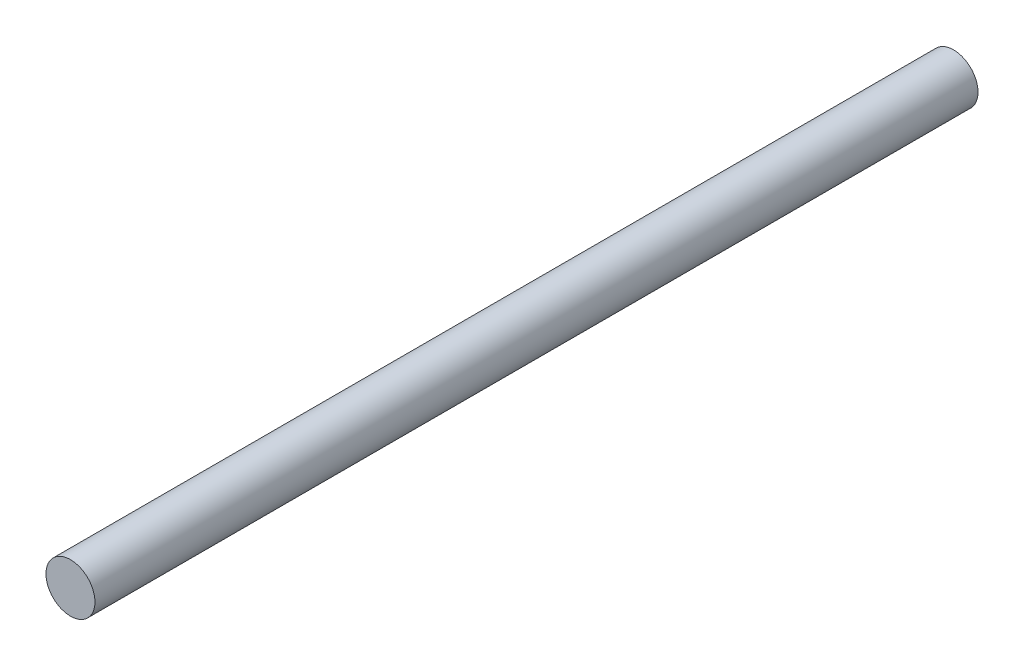
ISO-10303-21;
HEADER;
FILE_DESCRIPTION(('STEP AP214'),'2;1');
FILE_NAME('part.step','',(''),(''),'','','');
FILE_SCHEMA(('AUTOMOTIVE_DESIGN { 1 0 10303 214 1 1 1 1 }'));
ENDSEC;
DATA;
#1=APPLICATION_CONTEXT('core data for automotive mechanical design processes');
#2=APPLICATION_PROTOCOL_DEFINITION('international standard','automotive_design',2000,#1);
#3=PRODUCT_CONTEXT('',#1,'mechanical');
#4=PRODUCT('Part','Part','',(#3));
#5=PRODUCT_RELATED_PRODUCT_CATEGORY('part','',(#4));
#6=PRODUCT_DEFINITION_FORMATION('','',#4);
#7=PRODUCT_DEFINITION_CONTEXT('part definition',#1,'design');
#8=PRODUCT_DEFINITION('design','',#6,#7);
#9=PRODUCT_DEFINITION_SHAPE('','',#8);
#10=(LENGTH_UNIT() NAMED_UNIT(*) SI_UNIT(.MILLI.,.METRE.));
#11=(NAMED_UNIT(*) PLANE_ANGLE_UNIT() SI_UNIT($,.RADIAN.));
#12=(NAMED_UNIT(*) SI_UNIT($,.STERADIAN.) SOLID_ANGLE_UNIT());
#13=UNCERTAINTY_MEASURE_WITH_UNIT(LENGTH_MEASURE(1.E-05),#10,'distance_accuracy_value','');
#14=(GEOMETRIC_REPRESENTATION_CONTEXT(3) GLOBAL_UNCERTAINTY_ASSIGNED_CONTEXT((#13)) GLOBAL_UNIT_ASSIGNED_CONTEXT((#10,
#11,#12)) REPRESENTATION_CONTEXT('',''));
#15=CARTESIAN_POINT('',(0.,0.,0.));
#16=DIRECTION('',(0.,0.,1.));
#17=DIRECTION('',(1.,0.,0.));
#18=AXIS2_PLACEMENT_3D('',#15,#16,#17);
#19=CARTESIAN_POINT('',(11.5740029875136,0.20807919722147,-75.));
#20=DIRECTION('',(0.,0.,1.));
#21=DIRECTION('',(1.,0.,0.));
#22=AXIS2_PLACEMENT_3D('',#19,#20,#21);
#23=CYLINDRICAL_SURFACE('',#22,2.08005008782525);
#24=CARTESIAN_POINT('',(11.5740029875136,0.20807919722147,-75.));
#25=DIRECTION('',(0.,0.,1.));
#26=DIRECTION('',(1.,0.,0.));
#27=AXIS2_PLACEMENT_3D('',#24,#25,#26);
#28=CIRCLE('',#27,2.08005008782525);
#29=CARTESIAN_POINT('',(13.6540530753388,0.20807919722147,-75.));
#30=VERTEX_POINT('',#29);
#31=EDGE_CURVE('E10',#30,#30,#28,.T.);
#32=ORIENTED_EDGE('',*,*,#31,.T.);
#33=EDGE_LOOP('',(#32));
#34=FACE_BOUND('',#33,.T.);
#35=CARTESIAN_POINT('',(11.5740029875136,0.20807919722147,0.));
#36=DIRECTION('',(0.,0.,1.));
#37=DIRECTION('',(1.,0.,0.));
#38=AXIS2_PLACEMENT_3D('',#35,#36,#37);
#39=CIRCLE('',#38,2.08005008782525);
#40=CARTESIAN_POINT('',(13.6540530753388,0.20807919722147,0.));
#41=VERTEX_POINT('',#40);
#42=EDGE_CURVE('E33',#41,#41,#39,.T.);
#43=ORIENTED_EDGE('',*,*,#42,.F.);
#44=EDGE_LOOP('',(#43));
#45=FACE_BOUND('',#44,.T.);
#46=ADVANCED_FACE('F30',(#34,#45),#23,.T.);
#47=CARTESIAN_POINT('',(11.5740029875136,0.20807919722147,-75.));
#48=DIRECTION('',(0.,0.,1.));
#49=DIRECTION('',(1.,0.,0.));
#50=AXIS2_PLACEMENT_3D('',#47,#48,#49);
#51=PLANE('',#50);
#52=ORIENTED_EDGE('',*,*,#31,.F.);
#53=EDGE_LOOP('',(#52));
#54=FACE_BOUND('',#53,.T.);
#55=ADVANCED_FACE('F45',(#54),#51,.F.);
#56=CARTESIAN_POINT('',(11.5740029875136,0.20807919722147,0.));
#57=DIRECTION('',(0.,0.,1.));
#58=DIRECTION('',(1.,0.,0.));
#59=AXIS2_PLACEMENT_3D('',#56,#57,#58);
#60=PLANE('',#59);
#61=ORIENTED_EDGE('',*,*,#42,.T.);
#62=EDGE_LOOP('',(#61));
#63=FACE_BOUND('',#62,.T.);
#64=ADVANCED_FACE('F42',(#63),#60,.T.);
#65=CLOSED_SHELL('',(#46,#55,#64));
#66=MANIFOLD_SOLID_BREP('B2',#65);
#67=ADVANCED_BREP_SHAPE_REPRESENTATION('',(#18,#66),#14);
#68=SHAPE_DEFINITION_REPRESENTATION(#9,#67);
ENDSEC;
END-ISO-10303-21;
